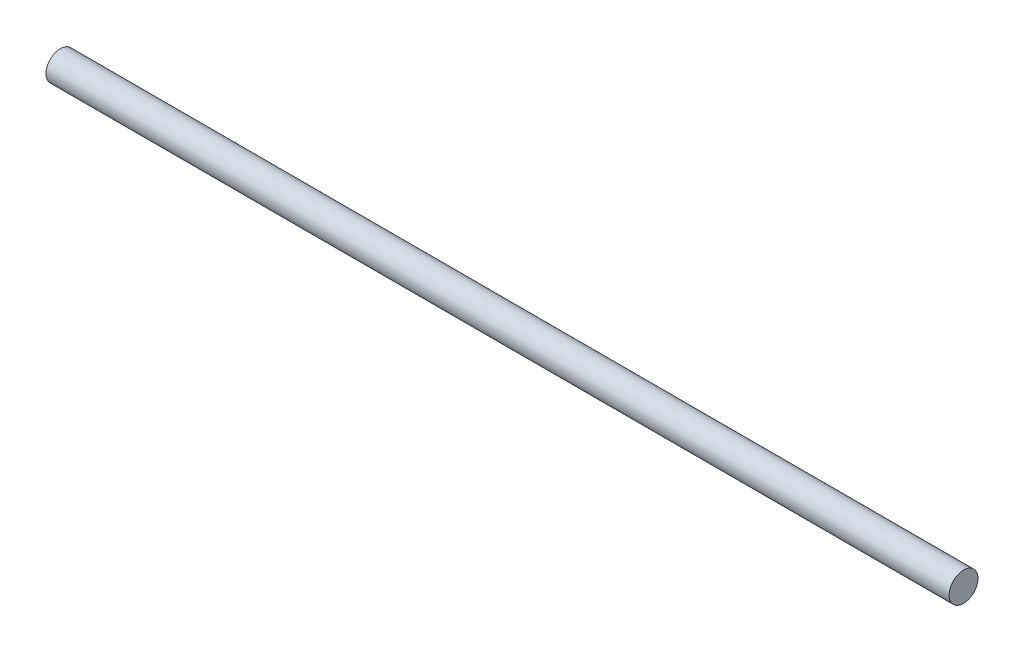
ISO-10303-21;
HEADER;
FILE_DESCRIPTION(('STEP AP214'),'2;1');
FILE_NAME('part.step','',(''),(''),'','','');
FILE_SCHEMA(('AUTOMOTIVE_DESIGN { 1 0 10303 214 1 1 1 1 }'));
ENDSEC;
DATA;
#1=APPLICATION_CONTEXT('core data for automotive mechanical design processes');
#2=APPLICATION_PROTOCOL_DEFINITION('international standard','automotive_design',2000,#1);
#3=PRODUCT_CONTEXT('',#1,'mechanical');
#4=PRODUCT('Part','Part','',(#3));
#5=PRODUCT_RELATED_PRODUCT_CATEGORY('part','',(#4));
#6=PRODUCT_DEFINITION_FORMATION('','',#4);
#7=PRODUCT_DEFINITION_CONTEXT('part definition',#1,'design');
#8=PRODUCT_DEFINITION('design','',#6,#7);
#9=PRODUCT_DEFINITION_SHAPE('','',#8);
#10=(LENGTH_UNIT() NAMED_UNIT(*) SI_UNIT(.MILLI.,.METRE.));
#11=(NAMED_UNIT(*) PLANE_ANGLE_UNIT() SI_UNIT($,.RADIAN.));
#12=(NAMED_UNIT(*) SI_UNIT($,.STERADIAN.) SOLID_ANGLE_UNIT());
#13=UNCERTAINTY_MEASURE_WITH_UNIT(LENGTH_MEASURE(1.E-05),#10,'distance_accuracy_value','');
#14=(GEOMETRIC_REPRESENTATION_CONTEXT(3) GLOBAL_UNCERTAINTY_ASSIGNED_CONTEXT((#13)) GLOBAL_UNIT_ASSIGNED_CONTEXT((#10,
#11,#12)) REPRESENTATION_CONTEXT('',''));
#15=CARTESIAN_POINT('',(0.,0.,0.));
#16=DIRECTION('',(0.,0.,1.));
#17=DIRECTION('',(1.,0.,0.));
#18=AXIS2_PLACEMENT_3D('',#15,#16,#17);
#19=CARTESIAN_POINT('',(250.,0.,0.));
#20=DIRECTION('',(-1.,0.,0.));
#21=DIRECTION('',(0.,0.,1.));
#22=AXIS2_PLACEMENT_3D('',#19,#20,#21);
#23=CYLINDRICAL_SURFACE('',#22,4.);
#24=CARTESIAN_POINT('',(250.,0.,0.));
#25=DIRECTION('',(1.,0.,0.));
#26=DIRECTION('',(0.,0.,-1.));
#27=AXIS2_PLACEMENT_3D('',#24,#25,#26);
#28=CIRCLE('',#27,4.);
#29=CARTESIAN_POINT('',(250.,0.,-4.));
#30=VERTEX_POINT('',#29);
#31=EDGE_CURVE('E10',#30,#30,#28,.T.);
#32=ORIENTED_EDGE('',*,*,#31,.F.);
#33=EDGE_LOOP('',(#32));
#34=FACE_BOUND('',#33,.T.);
#35=CARTESIAN_POINT('',(0.,0.,0.));
#36=DIRECTION('',(1.,0.,0.));
#37=DIRECTION('',(0.,0.,-1.));
#38=AXIS2_PLACEMENT_3D('',#35,#36,#37);
#39=CIRCLE('',#38,4.);
#40=CARTESIAN_POINT('',(0.,0.,-4.));
#41=VERTEX_POINT('',#40);
#42=EDGE_CURVE('E34',#41,#41,#39,.T.);
#43=ORIENTED_EDGE('',*,*,#42,.T.);
#44=EDGE_LOOP('',(#43));
#45=FACE_BOUND('',#44,.T.);
#46=ADVANCED_FACE('F31',(#34,#45),#23,.T.);
#47=CARTESIAN_POINT('',(250.,0.,0.));
#48=DIRECTION('',(1.,0.,0.));
#49=DIRECTION('',(0.,0.,-1.));
#50=AXIS2_PLACEMENT_3D('',#47,#48,#49);
#51=PLANE('',#50);
#52=ORIENTED_EDGE('',*,*,#31,.T.);
#53=EDGE_LOOP('',(#52));
#54=FACE_BOUND('',#53,.T.);
#55=ADVANCED_FACE('F46',(#54),#51,.T.);
#56=CARTESIAN_POINT('',(0.,0.,0.));
#57=DIRECTION('',(1.,0.,0.));
#58=DIRECTION('',(0.,0.,-1.));
#59=AXIS2_PLACEMENT_3D('',#56,#57,#58);
#60=PLANE('',#59);
#61=ORIENTED_EDGE('',*,*,#42,.F.);
#62=EDGE_LOOP('',(#61));
#63=FACE_BOUND('',#62,.T.);
#64=ADVANCED_FACE('F44',(#63),#60,.F.);
#65=CLOSED_SHELL('',(#46,#55,#64));
#66=MANIFOLD_SOLID_BREP('B2',#65);
#67=ADVANCED_BREP_SHAPE_REPRESENTATION('',(#18,#66),#14);
#68=SHAPE_DEFINITION_REPRESENTATION(#9,#67);
ENDSEC;
END-ISO-10303-21;
